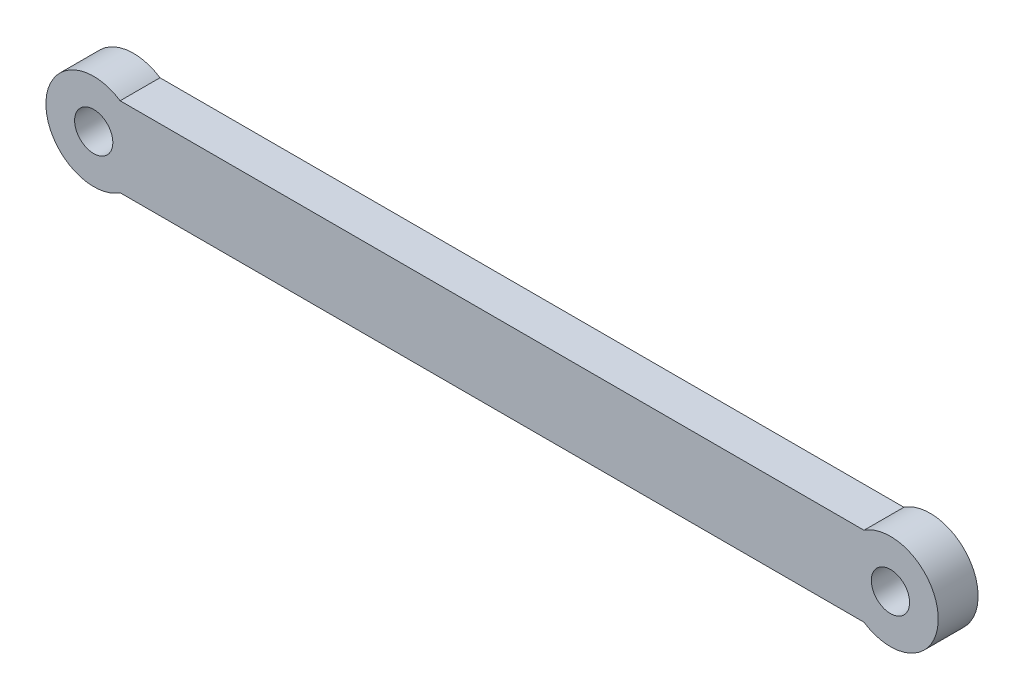
ISO-10303-21;
HEADER;
FILE_DESCRIPTION(('STEP AP214'),'2;1');
FILE_NAME('part.step','',(''),(''),'','','');
FILE_SCHEMA(('AUTOMOTIVE_DESIGN { 1 0 10303 214 1 1 1 1 }'));
ENDSEC;
DATA;
#1=APPLICATION_CONTEXT('core data for automotive mechanical design processes');
#2=APPLICATION_PROTOCOL_DEFINITION('international standard','automotive_design',2000,#1);
#3=PRODUCT_CONTEXT('',#1,'mechanical');
#4=PRODUCT('Part','Part','',(#3));
#5=PRODUCT_RELATED_PRODUCT_CATEGORY('part','',(#4));
#6=PRODUCT_DEFINITION_FORMATION('','',#4);
#7=PRODUCT_DEFINITION_CONTEXT('part definition',#1,'design');
#8=PRODUCT_DEFINITION('design','',#6,#7);
#9=PRODUCT_DEFINITION_SHAPE('','',#8);
#10=(LENGTH_UNIT() NAMED_UNIT(*) SI_UNIT(.MILLI.,.METRE.));
#11=(NAMED_UNIT(*) PLANE_ANGLE_UNIT() SI_UNIT($,.RADIAN.));
#12=(NAMED_UNIT(*) SI_UNIT($,.STERADIAN.) SOLID_ANGLE_UNIT());
#13=UNCERTAINTY_MEASURE_WITH_UNIT(LENGTH_MEASURE(1.E-05),#10,'distance_accuracy_value','');
#14=(GEOMETRIC_REPRESENTATION_CONTEXT(3) GLOBAL_UNCERTAINTY_ASSIGNED_CONTEXT((#13)) GLOBAL_UNIT_ASSIGNED_CONTEXT((#10,
#11,#12)) REPRESENTATION_CONTEXT('',''));
#15=CARTESIAN_POINT('',(0.,0.,0.));
#16=DIRECTION('',(0.,0.,1.));
#17=DIRECTION('',(1.,0.,0.));
#18=AXIS2_PLACEMENT_3D('',#15,#16,#17);
#19=CARTESIAN_POINT('',(0.,-2.5,2.5));
#20=DIRECTION('',(0.,1.,0.));
#21=DIRECTION('',(0.,0.,1.));
#22=AXIS2_PLACEMENT_3D('',#19,#20,#21);
#23=PLANE('',#22);
#24=DIRECTION('',(1.,0.,0.));
#25=VECTOR('',#24,1.);
#26=CARTESIAN_POINT('',(0.,-2.5,2.5));
#27=LINE('',#26,#25);
#28=CARTESIAN_POINT('',(1.6583123951777,-2.5,2.5));
#29=VERTEX_POINT('',#28);
#30=CARTESIAN_POINT('',(48.3416876048223,-2.5,2.5));
#31=VERTEX_POINT('',#30);
#32=EDGE_CURVE('E63',#29,#31,#27,.T.);
#33=ORIENTED_EDGE('',*,*,#32,.F.);
#34=DIRECTION('',(0.,0.,1.));
#35=VECTOR('',#34,1.);
#36=CARTESIAN_POINT('',(1.6583123951777,-2.5,0.));
#37=LINE('',#36,#35);
#38=CARTESIAN_POINT('',(1.6583123951777,-2.5,0.));
#39=VERTEX_POINT('',#38);
#40=EDGE_CURVE('E90',#29,#39,#37,.F.);
#41=ORIENTED_EDGE('',*,*,#40,.T.);
#42=DIRECTION('',(1.,0.,0.));
#43=VECTOR('',#42,1.);
#44=CARTESIAN_POINT('',(0.,-2.5,0.));
#45=LINE('',#44,#43);
#46=CARTESIAN_POINT('',(48.3416876048223,-2.5,0.));
#47=VERTEX_POINT('',#46);
#48=EDGE_CURVE('E98',#39,#47,#45,.T.);
#49=ORIENTED_EDGE('',*,*,#48,.T.);
#50=DIRECTION('',(0.,0.,1.));
#51=VECTOR('',#50,1.);
#52=CARTESIAN_POINT('',(48.3416876048223,-2.5,0.));
#53=LINE('',#52,#51);
#54=EDGE_CURVE('E106',#47,#31,#53,.T.);
#55=ORIENTED_EDGE('',*,*,#54,.T.);
#56=EDGE_LOOP('',(#33,#41,#49,#55));
#57=FACE_BOUND('',#56,.T.);
#58=ADVANCED_FACE('F39',(#57),#23,.F.);
#59=CARTESIAN_POINT('',(0.,2.5,2.5));
#60=DIRECTION('',(0.,1.,0.));
#61=DIRECTION('',(0.,0.,1.));
#62=AXIS2_PLACEMENT_3D('',#59,#60,#61);
#63=PLANE('',#62);
#64=DIRECTION('',(0.,0.,1.));
#65=VECTOR('',#64,1.);
#66=CARTESIAN_POINT('',(1.6583123951777,2.5,0.));
#67=LINE('',#66,#65);
#68=CARTESIAN_POINT('',(1.6583123951777,2.5,2.5));
#69=VERTEX_POINT('',#68);
#70=CARTESIAN_POINT('',(1.6583123951777,2.5,0.));
#71=VERTEX_POINT('',#70);
#72=EDGE_CURVE('E83',#69,#71,#67,.F.);
#73=ORIENTED_EDGE('',*,*,#72,.F.);
#74=DIRECTION('',(1.,0.,0.));
#75=VECTOR('',#74,1.);
#76=CARTESIAN_POINT('',(0.,2.5,2.5));
#77=LINE('',#76,#75);
#78=CARTESIAN_POINT('',(48.3416876048223,2.5,2.5));
#79=VERTEX_POINT('',#78);
#80=EDGE_CURVE('E55',#69,#79,#77,.T.);
#81=ORIENTED_EDGE('',*,*,#80,.T.);
#82=DIRECTION('',(0.,0.,1.));
#83=VECTOR('',#82,1.);
#84=CARTESIAN_POINT('',(48.3416876048223,2.5,0.));
#85=LINE('',#84,#83);
#86=CARTESIAN_POINT('',(48.3416876048223,2.5,0.));
#87=VERTEX_POINT('',#86);
#88=EDGE_CURVE('E101',#87,#79,#85,.T.);
#89=ORIENTED_EDGE('',*,*,#88,.F.);
#90=DIRECTION('',(1.,0.,0.));
#91=VECTOR('',#90,1.);
#92=CARTESIAN_POINT('',(0.,2.5,0.));
#93=LINE('',#92,#91);
#94=EDGE_CURVE('E97',#71,#87,#93,.T.);
#95=ORIENTED_EDGE('',*,*,#94,.F.);
#96=EDGE_LOOP('',(#73,#81,#89,#95));
#97=FACE_BOUND('',#96,.T.);
#98=ADVANCED_FACE('F100',(#97),#63,.T.);
#99=CARTESIAN_POINT('',(0.,0.,2.5));
#100=DIRECTION('',(0.,0.,-1.));
#101=DIRECTION('',(-1.,0.,0.));
#102=AXIS2_PLACEMENT_3D('',#99,#100,#101);
#103=CYLINDRICAL_SURFACE('',#102,1.2);
#104=CARTESIAN_POINT('',(0.,0.,2.5));
#105=DIRECTION('',(0.,0.,1.));
#106=DIRECTION('',(1.,0.,0.));
#107=AXIS2_PLACEMENT_3D('',#104,#105,#106);
#108=CIRCLE('',#107,1.2);
#109=CARTESIAN_POINT('',(1.2,0.,2.5));
#110=VERTEX_POINT('',#109);
#111=EDGE_CURVE('E47',#110,#110,#108,.T.);
#112=ORIENTED_EDGE('',*,*,#111,.T.);
#113=EDGE_LOOP('',(#112));
#114=FACE_BOUND('',#113,.T.);
#115=CARTESIAN_POINT('',(0.,0.,0.));
#116=DIRECTION('',(0.,0.,1.));
#117=DIRECTION('',(1.,0.,0.));
#118=AXIS2_PLACEMENT_3D('',#115,#116,#117);
#119=CIRCLE('',#118,1.2);
#120=CARTESIAN_POINT('',(1.2,0.,0.));
#121=VERTEX_POINT('',#120);
#122=EDGE_CURVE('E103',#121,#121,#119,.T.);
#123=ORIENTED_EDGE('',*,*,#122,.F.);
#124=EDGE_LOOP('',(#123));
#125=FACE_BOUND('',#124,.T.);
#126=ADVANCED_FACE('F140',(#114,#125),#103,.F.);
#127=CARTESIAN_POINT('',(50.,0.,2.5));
#128=DIRECTION('',(0.,0.,-1.));
#129=DIRECTION('',(-1.,0.,0.));
#130=AXIS2_PLACEMENT_3D('',#127,#128,#129);
#131=CYLINDRICAL_SURFACE('',#130,1.2);
#132=CARTESIAN_POINT('',(50.,0.,2.5));
#133=DIRECTION('',(0.,0.,1.));
#134=DIRECTION('',(1.,0.,0.));
#135=AXIS2_PLACEMENT_3D('',#132,#133,#134);
#136=CIRCLE('',#135,1.2);
#137=CARTESIAN_POINT('',(51.2,0.,2.5));
#138=VERTEX_POINT('',#137);
#139=EDGE_CURVE('E11',#138,#138,#136,.T.);
#140=ORIENTED_EDGE('',*,*,#139,.T.);
#141=EDGE_LOOP('',(#140));
#142=FACE_BOUND('',#141,.T.);
#143=CARTESIAN_POINT('',(50.,0.,0.));
#144=DIRECTION('',(0.,0.,1.));
#145=DIRECTION('',(1.,0.,0.));
#146=AXIS2_PLACEMENT_3D('',#143,#144,#145);
#147=CIRCLE('',#146,1.2);
#148=CARTESIAN_POINT('',(51.2,0.,0.));
#149=VERTEX_POINT('',#148);
#150=EDGE_CURVE('E42',#149,#149,#147,.T.);
#151=ORIENTED_EDGE('',*,*,#150,.F.);
#152=EDGE_LOOP('',(#151));
#153=FACE_BOUND('',#152,.T.);
#154=ADVANCED_FACE('F144',(#142,#153),#131,.F.);
#155=CARTESIAN_POINT('',(0.,0.,2.5));
#156=DIRECTION('',(0.,0.,1.));
#157=DIRECTION('',(1.,0.,0.));
#158=AXIS2_PLACEMENT_3D('',#155,#156,#157);
#159=PLANE('',#158);
#160=CARTESIAN_POINT('',(0.,0.,2.5));
#161=DIRECTION('',(0.,0.,1.));
#162=DIRECTION('',(1.,0.,0.));
#163=AXIS2_PLACEMENT_3D('',#160,#161,#162);
#164=CIRCLE('',#163,3.);
#165=EDGE_CURVE('E88',#69,#29,#164,.T.);
#166=ORIENTED_EDGE('',*,*,#165,.T.);
#167=ORIENTED_EDGE('',*,*,#32,.T.);
#168=CARTESIAN_POINT('',(50.,0.,2.5));
#169=DIRECTION('',(0.,0.,1.));
#170=DIRECTION('',(1.,0.,0.));
#171=AXIS2_PLACEMENT_3D('',#168,#169,#170);
#172=CIRCLE('',#171,3.);
#173=EDGE_CURVE('E116',#31,#79,#172,.T.);
#174=ORIENTED_EDGE('',*,*,#173,.T.);
#175=ORIENTED_EDGE('',*,*,#80,.F.);
#176=EDGE_LOOP('',(#166,#167,#174,#175));
#177=FACE_BOUND('',#176,.T.);
#178=ORIENTED_EDGE('',*,*,#139,.F.);
#179=EDGE_LOOP('',(#178));
#180=FACE_BOUND('',#179,.T.);
#181=ORIENTED_EDGE('',*,*,#111,.F.);
#182=EDGE_LOOP('',(#181));
#183=FACE_BOUND('',#182,.T.);
#184=ADVANCED_FACE('F120',(#177,#180,#183),#159,.T.);
#185=CARTESIAN_POINT('',(0.,0.,0.));
#186=DIRECTION('',(0.,0.,1.));
#187=DIRECTION('',(1.,0.,0.));
#188=AXIS2_PLACEMENT_3D('',#185,#186,#187);
#189=PLANE('',#188);
#190=ORIENTED_EDGE('',*,*,#48,.F.);
#191=CARTESIAN_POINT('',(0.,0.,0.));
#192=DIRECTION('',(0.,0.,1.));
#193=DIRECTION('',(1.,0.,0.));
#194=AXIS2_PLACEMENT_3D('',#191,#192,#193);
#195=CIRCLE('',#194,3.);
#196=EDGE_CURVE('E86',#71,#39,#195,.T.);
#197=ORIENTED_EDGE('',*,*,#196,.F.);
#198=ORIENTED_EDGE('',*,*,#94,.T.);
#199=CARTESIAN_POINT('',(50.,0.,0.));
#200=DIRECTION('',(0.,0.,1.));
#201=DIRECTION('',(1.,0.,0.));
#202=AXIS2_PLACEMENT_3D('',#199,#200,#201);
#203=CIRCLE('',#202,3.);
#204=EDGE_CURVE('E115',#47,#87,#203,.T.);
#205=ORIENTED_EDGE('',*,*,#204,.F.);
#206=EDGE_LOOP('',(#190,#197,#198,#205));
#207=FACE_BOUND('',#206,.T.);
#208=ORIENTED_EDGE('',*,*,#150,.T.);
#209=EDGE_LOOP('',(#208));
#210=FACE_BOUND('',#209,.T.);
#211=ORIENTED_EDGE('',*,*,#122,.T.);
#212=EDGE_LOOP('',(#211));
#213=FACE_BOUND('',#212,.T.);
#214=ADVANCED_FACE('F94',(#207,#210,#213),#189,.F.);
#215=CARTESIAN_POINT('',(50.,0.,0.));
#216=DIRECTION('',(0.,0.,1.));
#217=DIRECTION('',(1.,0.,0.));
#218=AXIS2_PLACEMENT_3D('',#215,#216,#217);
#219=CYLINDRICAL_SURFACE('',#218,3.);
#220=ORIENTED_EDGE('',*,*,#54,.F.);
#221=ORIENTED_EDGE('',*,*,#204,.T.);
#222=ORIENTED_EDGE('',*,*,#88,.T.);
#223=ORIENTED_EDGE('',*,*,#173,.F.);
#224=EDGE_LOOP('',(#220,#221,#222,#223));
#225=FACE_BOUND('',#224,.T.);
#226=ADVANCED_FACE('F126',(#225),#219,.T.);
#227=CARTESIAN_POINT('',(0.,0.,0.));
#228=DIRECTION('',(0.,0.,1.));
#229=DIRECTION('',(1.,0.,0.));
#230=AXIS2_PLACEMENT_3D('',#227,#228,#229);
#231=CYLINDRICAL_SURFACE('',#230,3.);
#232=ORIENTED_EDGE('',*,*,#40,.F.);
#233=ORIENTED_EDGE('',*,*,#165,.F.);
#234=ORIENTED_EDGE('',*,*,#72,.T.);
#235=ORIENTED_EDGE('',*,*,#196,.T.);
#236=EDGE_LOOP('',(#232,#233,#234,#235));
#237=FACE_BOUND('',#236,.T.);
#238=ADVANCED_FACE('F85',(#237),#231,.T.);
#239=CLOSED_SHELL('',(#58,#98,#126,#154,#184,#214,#226,#238));
#240=MANIFOLD_SOLID_BREP('B2',#239);
#241=ADVANCED_BREP_SHAPE_REPRESENTATION('',(#18,#240),#14);
#242=SHAPE_DEFINITION_REPRESENTATION(#9,#241);
ENDSEC;
END-ISO-10303-21;
